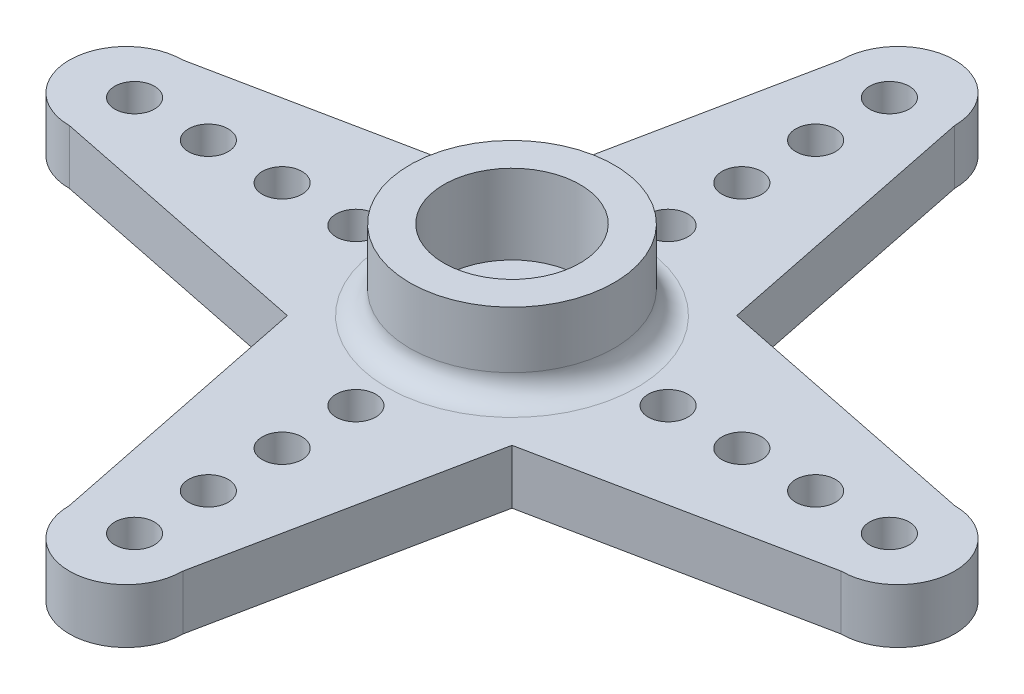
ISO-10303-21;
HEADER;
FILE_DESCRIPTION(('STEP AP214'),'2;1');
FILE_NAME('part.step','',(''),(''),'','','');
FILE_SCHEMA(('AUTOMOTIVE_DESIGN { 1 0 10303 214 1 1 1 1 }'));
ENDSEC;
DATA;
#1=APPLICATION_CONTEXT('core data for automotive mechanical design processes');
#2=APPLICATION_PROTOCOL_DEFINITION('international standard','automotive_design',2000,#1);
#3=PRODUCT_CONTEXT('',#1,'mechanical');
#4=PRODUCT('Part','Part','',(#3));
#5=PRODUCT_RELATED_PRODUCT_CATEGORY('part','',(#4));
#6=PRODUCT_DEFINITION_FORMATION('','',#4);
#7=PRODUCT_DEFINITION_CONTEXT('part definition',#1,'design');
#8=PRODUCT_DEFINITION('design','',#6,#7);
#9=PRODUCT_DEFINITION_SHAPE('','',#8);
#10=(LENGTH_UNIT() NAMED_UNIT(*) SI_UNIT(.MILLI.,.METRE.));
#11=(NAMED_UNIT(*) PLANE_ANGLE_UNIT() SI_UNIT($,.RADIAN.));
#12=(NAMED_UNIT(*) SI_UNIT($,.STERADIAN.) SOLID_ANGLE_UNIT());
#13=UNCERTAINTY_MEASURE_WITH_UNIT(LENGTH_MEASURE(1.E-05),#10,'distance_accuracy_value','');
#14=(GEOMETRIC_REPRESENTATION_CONTEXT(3) GLOBAL_UNCERTAINTY_ASSIGNED_CONTEXT((#13)) GLOBAL_UNIT_ASSIGNED_CONTEXT((#10,
#11,#12)) REPRESENTATION_CONTEXT('',''));
#15=CARTESIAN_POINT('',(0.,0.,0.));
#16=DIRECTION('',(0.,0.,1.));
#17=DIRECTION('',(1.,0.,0.));
#18=AXIS2_PLACEMENT_3D('',#15,#16,#17);
#19=CARTESIAN_POINT('',(0.,2.4,0.));
#20=DIRECTION('',(0.,-1.,0.));
#21=DIRECTION('',(0.,0.,-1.));
#22=AXIS2_PLACEMENT_3D('',#19,#20,#21);
#23=CYLINDRICAL_SURFACE('',#22,1.5);
#24=CARTESIAN_POINT('',(0.,2.4,0.));
#25=DIRECTION('',(0.,1.,0.));
#26=DIRECTION('',(0.,0.,1.));
#27=AXIS2_PLACEMENT_3D('',#24,#25,#26);
#28=CIRCLE('',#27,1.5);
#29=CARTESIAN_POINT('',(0.,2.4,1.5));
#30=VERTEX_POINT('',#29);
#31=EDGE_CURVE('E181',#30,#30,#28,.T.);
#32=ORIENTED_EDGE('',*,*,#31,.T.);
#33=EDGE_LOOP('',(#32));
#34=FACE_BOUND('',#33,.T.);
#35=CARTESIAN_POINT('',(0.,0.5,0.));
#36=DIRECTION('',(0.,-1.,0.));
#37=DIRECTION('',(0.,0.,-1.));
#38=AXIS2_PLACEMENT_3D('',#35,#36,#37);
#39=CIRCLE('',#38,1.5);
#40=CARTESIAN_POINT('',(0.,0.5,-1.5));
#41=VERTEX_POINT('',#40);
#42=EDGE_CURVE('E50',#41,#41,#39,.T.);
#43=ORIENTED_EDGE('',*,*,#42,.T.);
#44=EDGE_LOOP('',(#43));
#45=FACE_BOUND('',#44,.T.);
#46=ADVANCED_FACE('F46',(#34,#45),#23,.F.);
#47=CARTESIAN_POINT('',(0.,2.4,-17.0016457774429));
#48=DIRECTION('',(0.,1.,0.));
#49=DIRECTION('',(0.,0.,1.));
#50=AXIS2_PLACEMENT_3D('',#47,#48,#49);
#51=PLANE('',#50);
#52=CARTESIAN_POINT('',(10.1266457774429,2.4,0.));
#53=DIRECTION('',(0.,-1.,0.));
#54=DIRECTION('',(0.,0.,-1.));
#55=AXIS2_PLACEMENT_3D('',#52,#53,#54);
#56=CIRCLE('',#55,0.875000000000001);
#57=CARTESIAN_POINT('',(10.1266457774429,2.4,-0.875000000000037));
#58=VERTEX_POINT('',#57);
#59=EDGE_CURVE('E525',#58,#58,#56,.T.);
#60=ORIENTED_EDGE('',*,*,#59,.T.);
#61=EDGE_LOOP('',(#60));
#62=FACE_BOUND('',#61,.T.);
#63=CARTESIAN_POINT('',(16.6266457774429,2.4,0.));
#64=DIRECTION('',(0.,1.,0.));
#65=DIRECTION('',(0.,0.,1.));
#66=AXIS2_PLACEMENT_3D('',#63,#64,#65);
#67=CIRCLE('',#66,0.875000000000002);
#68=CARTESIAN_POINT('',(16.6266457774429,2.4,0.874999999999943));
#69=VERTEX_POINT('',#68);
#70=EDGE_CURVE('E589',#69,#69,#67,.F.);
#71=ORIENTED_EDGE('',*,*,#70,.T.);
#72=EDGE_LOOP('',(#71));
#73=FACE_BOUND('',#72,.T.);
#74=CARTESIAN_POINT('',(13.3766457774429,2.4,0.));
#75=DIRECTION('',(0.,1.,0.));
#76=DIRECTION('',(0.,0.,1.));
#77=AXIS2_PLACEMENT_3D('',#74,#75,#76);
#78=CIRCLE('',#77,0.875000000000001);
#79=CARTESIAN_POINT('',(13.3766457774429,2.4,0.874999999999953));
#80=VERTEX_POINT('',#79);
#81=EDGE_CURVE('E582',#80,#80,#78,.F.);
#82=ORIENTED_EDGE('',*,*,#81,.T.);
#83=EDGE_LOOP('',(#82));
#84=FACE_BOUND('',#83,.T.);
#85=CARTESIAN_POINT('',(6.87664577744287,2.4,0.));
#86=DIRECTION('',(0.,1.,0.));
#87=DIRECTION('',(0.,0.,1.));
#88=AXIS2_PLACEMENT_3D('',#85,#86,#87);
#89=CIRCLE('',#88,0.875000000000001);
#90=CARTESIAN_POINT('',(6.87664577744287,2.4,0.874999999999977));
#91=VERTEX_POINT('',#90);
#92=EDGE_CURVE('E578',#91,#91,#89,.F.);
#93=ORIENTED_EDGE('',*,*,#92,.T.);
#94=EDGE_LOOP('',(#93));
#95=FACE_BOUND('',#94,.T.);
#96=CARTESIAN_POINT('',(-6.87664577744287,2.4,0.));
#97=DIRECTION('',(0.,1.,0.));
#98=DIRECTION('',(0.,0.,1.));
#99=AXIS2_PLACEMENT_3D('',#96,#97,#98);
#100=CIRCLE('',#99,0.875);
#101=CARTESIAN_POINT('',(-6.87664577744287,2.4,0.87500000000007));
#102=VERTEX_POINT('',#101);
#103=EDGE_CURVE('E332',#102,#102,#100,.F.);
#104=ORIENTED_EDGE('',*,*,#103,.T.);
#105=EDGE_LOOP('',(#104));
#106=FACE_BOUND('',#105,.T.);
#107=CARTESIAN_POINT('',(-16.6266457774429,2.4,1.70002900645727E-13));
#108=DIRECTION('',(0.,1.,0.));
#109=DIRECTION('',(0.,0.,1.));
#110=AXIS2_PLACEMENT_3D('',#107,#108,#109);
#111=CIRCLE('',#110,0.875);
#112=CARTESIAN_POINT('',(-16.6266457774429,2.4,0.87500000000017));
#113=VERTEX_POINT('',#112);
#114=EDGE_CURVE('E510',#113,#113,#111,.F.);
#115=ORIENTED_EDGE('',*,*,#114,.T.);
#116=EDGE_LOOP('',(#115));
#117=FACE_BOUND('',#116,.T.);
#118=CARTESIAN_POINT('',(-13.3766457774429,2.4,1.37043154602168E-13));
#119=DIRECTION('',(0.,1.,0.));
#120=DIRECTION('',(0.,0.,1.));
#121=AXIS2_PLACEMENT_3D('',#118,#119,#120);
#122=CIRCLE('',#121,0.875000000000001);
#123=CARTESIAN_POINT('',(-13.3766457774429,2.4,0.875000000000138));
#124=VERTEX_POINT('',#123);
#125=EDGE_CURVE('E513',#124,#124,#122,.F.);
#126=ORIENTED_EDGE('',*,*,#125,.T.);
#127=EDGE_LOOP('',(#126));
#128=FACE_BOUND('',#127,.T.);
#129=CARTESIAN_POINT('',(-10.1266457774429,2.4,1.02348685082632E-13));
#130=DIRECTION('',(0.,1.,0.));
#131=DIRECTION('',(0.,0.,1.));
#132=AXIS2_PLACEMENT_3D('',#129,#130,#131);
#133=CIRCLE('',#132,0.875000000000001);
#134=CARTESIAN_POINT('',(-10.1266457774429,2.4,0.875000000000103));
#135=VERTEX_POINT('',#134);
#136=EDGE_CURVE('E519',#135,#135,#133,.F.);
#137=ORIENTED_EDGE('',*,*,#136,.T.);
#138=EDGE_LOOP('',(#137));
#139=FACE_BOUND('',#138,.T.);
#140=CARTESIAN_POINT('',(0.,2.4,0.));
#141=DIRECTION('',(0.,1.,0.));
#142=DIRECTION('',(0.,0.,1.));
#143=AXIS2_PLACEMENT_3D('',#140,#141,#142);
#144=CIRCLE('',#143,5.5);
#145=CARTESIAN_POINT('',(0.,2.4,5.5));
#146=VERTEX_POINT('',#145);
#147=EDGE_CURVE('E12',#146,#146,#144,.F.);
#148=ORIENTED_EDGE('',*,*,#147,.T.);
#149=EDGE_LOOP('',(#148));
#150=FACE_BOUND('',#149,.T.);
#151=DIRECTION('',(-0.199193114188229,0.,-0.979960255959391));
#152=VECTOR('',#151,1.);
#153=CARTESIAN_POINT('',(4.94974746830583,2.4,-4.94974746830583));
#154=LINE('',#153,#152);
#155=CARTESIAN_POINT('',(4.94974746830583,2.4,-4.94974746830583));
#156=VERTEX_POINT('',#155);
#157=CARTESIAN_POINT('',(2.5,2.4,-17.0016457774429));
#158=VERTEX_POINT('',#157);
#159=EDGE_CURVE('E211',#156,#158,#154,.T.);
#160=ORIENTED_EDGE('',*,*,#159,.T.);
#161=CARTESIAN_POINT('',(0.,2.4,-17.0016457774429));
#162=DIRECTION('',(0.,1.,0.));
#163=DIRECTION('',(0.,0.,1.));
#164=AXIS2_PLACEMENT_3D('',#161,#162,#163);
#165=CIRCLE('',#164,2.5);
#166=CARTESIAN_POINT('',(-2.5,2.4,-17.0016457774429));
#167=VERTEX_POINT('',#166);
#168=EDGE_CURVE('E122',#158,#167,#165,.T.);
#169=ORIENTED_EDGE('',*,*,#168,.T.);
#170=DIRECTION('',(-0.199193114188229,0.,0.979960255959391));
#171=VECTOR('',#170,1.);
#172=CARTESIAN_POINT('',(-2.5,2.4,-17.0016457774429));
#173=LINE('',#172,#171);
#174=CARTESIAN_POINT('',(-4.94974746830583,2.4,-4.94974746830583));
#175=VERTEX_POINT('',#174);
#176=EDGE_CURVE('E342',#167,#175,#173,.T.);
#177=ORIENTED_EDGE('',*,*,#176,.T.);
#178=DIRECTION('',(-0.979952252684368,0.,0.199232483442915));
#179=VECTOR('',#178,1.);
#180=CARTESIAN_POINT('',(-16.999165859268,2.4,-2.5));
#181=LINE('',#180,#179);
#182=CARTESIAN_POINT('',(-16.999165859268,2.4,-2.5));
#183=VERTEX_POINT('',#182);
#184=EDGE_CURVE('E345',#175,#183,#181,.T.);
#185=ORIENTED_EDGE('',*,*,#184,.T.);
#186=CARTESIAN_POINT('',(-16.999165859268,2.4,0.));
#187=DIRECTION('',(0.,1.,0.));
#188=DIRECTION('',(0.,0.,1.));
#189=AXIS2_PLACEMENT_3D('',#186,#187,#188);
#190=CIRCLE('',#189,2.5);
#191=CARTESIAN_POINT('',(-16.999165859268,2.4,2.5));
#192=VERTEX_POINT('',#191);
#193=EDGE_CURVE('E348',#183,#192,#190,.T.);
#194=ORIENTED_EDGE('',*,*,#193,.T.);
#195=DIRECTION('',(0.979952252684368,0.,0.199232483442915));
#196=VECTOR('',#195,1.);
#197=CARTESIAN_POINT('',(-16.999165859268,2.4,2.5));
#198=LINE('',#197,#196);
#199=CARTESIAN_POINT('',(-4.94974746830583,2.4,4.94974746830583));
#200=VERTEX_POINT('',#199);
#201=EDGE_CURVE('E351',#192,#200,#198,.T.);
#202=ORIENTED_EDGE('',*,*,#201,.T.);
#203=DIRECTION('',(0.199219905240093,0.,0.979954809854071));
#204=VECTOR('',#203,1.);
#205=CARTESIAN_POINT('',(-4.94974746830583,2.4,4.94974746830583));
#206=LINE('',#205,#204);
#207=CARTESIAN_POINT('',(-2.5,2.4,16.9999580715132));
#208=VERTEX_POINT('',#207);
#209=EDGE_CURVE('E354',#200,#208,#206,.T.);
#210=ORIENTED_EDGE('',*,*,#209,.T.);
#211=CARTESIAN_POINT('',(0.,2.4,16.9999580715132));
#212=DIRECTION('',(0.,1.,0.));
#213=DIRECTION('',(0.,0.,1.));
#214=AXIS2_PLACEMENT_3D('',#211,#212,#213);
#215=CIRCLE('',#214,2.5);
#216=CARTESIAN_POINT('',(2.5,2.4,16.9999580715132));
#217=VERTEX_POINT('',#216);
#218=EDGE_CURVE('E357',#208,#217,#215,.T.);
#219=ORIENTED_EDGE('',*,*,#218,.T.);
#220=DIRECTION('',(0.199219905240093,0.,-0.979954809854071));
#221=VECTOR('',#220,1.);
#222=CARTESIAN_POINT('',(2.5,2.4,16.9999580715132));
#223=LINE('',#222,#221);
#224=CARTESIAN_POINT('',(4.94974746830583,2.4,4.94974746830583));
#225=VERTEX_POINT('',#224);
#226=EDGE_CURVE('E154',#217,#225,#223,.T.);
#227=ORIENTED_EDGE('',*,*,#226,.T.);
#228=DIRECTION('',(0.97995783729977,0.,-0.199205012775174));
#229=VECTOR('',#228,1.);
#230=CARTESIAN_POINT('',(4.94974746830583,2.4,4.94974746830583));
#231=LINE('',#230,#229);
#232=CARTESIAN_POINT('',(17.0008961694732,2.4,2.5));
#233=VERTEX_POINT('',#232);
#234=EDGE_CURVE('E147',#225,#233,#231,.T.);
#235=ORIENTED_EDGE('',*,*,#234,.T.);
#236=CARTESIAN_POINT('',(17.0008961694732,2.4,0.));
#237=DIRECTION('',(0.,1.,0.));
#238=DIRECTION('',(0.,0.,1.));
#239=AXIS2_PLACEMENT_3D('',#236,#237,#238);
#240=CIRCLE('',#239,2.5);
#241=CARTESIAN_POINT('',(17.0008961694732,2.4,-2.5));
#242=VERTEX_POINT('',#241);
#243=EDGE_CURVE('E152',#233,#242,#240,.T.);
#244=ORIENTED_EDGE('',*,*,#243,.T.);
#245=DIRECTION('',(-0.97995783729977,0.,-0.199205012775174));
#246=VECTOR('',#245,1.);
#247=CARTESIAN_POINT('',(17.0008961694732,2.4,-2.5));
#248=LINE('',#247,#246);
#249=EDGE_CURVE('E66',#242,#156,#248,.T.);
#250=ORIENTED_EDGE('',*,*,#249,.T.);
#251=EDGE_LOOP('',(#160,#169,#177,#185,#194,#202,#210,#219,#227,#235,#244,#250));
#252=FACE_BOUND('',#251,.T.);
#253=CARTESIAN_POINT('',(0.,2.4,-6.87664577744287));
#254=DIRECTION('',(0.,1.,0.));
#255=DIRECTION('',(0.,0.,1.));
#256=AXIS2_PLACEMENT_3D('',#253,#254,#255);
#257=CIRCLE('',#256,0.875);
#258=CARTESIAN_POINT('',(0.,2.4,-6.00164577744287));
#259=VERTEX_POINT('',#258);
#260=EDGE_CURVE('E514',#259,#259,#257,.T.);
#261=ORIENTED_EDGE('',*,*,#260,.F.);
#262=EDGE_LOOP('',(#261));
#263=FACE_BOUND('',#262,.T.);
#264=CARTESIAN_POINT('',(0.,2.4,6.87664577744287));
#265=DIRECTION('',(0.,1.,0.));
#266=DIRECTION('',(0.,0.,1.));
#267=AXIS2_PLACEMENT_3D('',#264,#265,#266);
#268=CIRCLE('',#267,0.875);
#269=CARTESIAN_POINT('',(0.,2.4,7.75164577744287));
#270=VERTEX_POINT('',#269);
#271=EDGE_CURVE('E538',#270,#270,#268,.T.);
#272=ORIENTED_EDGE('',*,*,#271,.F.);
#273=EDGE_LOOP('',(#272));
#274=FACE_BOUND('',#273,.T.);
#275=CARTESIAN_POINT('',(0.,2.4,10.1266457774429));
#276=DIRECTION('',(0.,1.,0.));
#277=DIRECTION('',(0.,0.,1.));
#278=AXIS2_PLACEMENT_3D('',#275,#276,#277);
#279=CIRCLE('',#278,0.875000000000001);
#280=CARTESIAN_POINT('',(0.,2.4,11.0016457774429));
#281=VERTEX_POINT('',#280);
#282=EDGE_CURVE('E535',#281,#281,#279,.T.);
#283=ORIENTED_EDGE('',*,*,#282,.F.);
#284=EDGE_LOOP('',(#283));
#285=FACE_BOUND('',#284,.T.);
#286=CARTESIAN_POINT('',(0.,2.4,13.3766457774429));
#287=DIRECTION('',(0.,1.,0.));
#288=DIRECTION('',(0.,0.,1.));
#289=AXIS2_PLACEMENT_3D('',#286,#287,#288);
#290=CIRCLE('',#289,0.875000000000002);
#291=CARTESIAN_POINT('',(0.,2.4,14.2516457774429));
#292=VERTEX_POINT('',#291);
#293=EDGE_CURVE('E531',#292,#292,#290,.T.);
#294=ORIENTED_EDGE('',*,*,#293,.F.);
#295=EDGE_LOOP('',(#294));
#296=FACE_BOUND('',#295,.T.);
#297=CARTESIAN_POINT('',(0.,2.4,-16.6266457774429));
#298=DIRECTION('',(0.,1.,0.));
#299=DIRECTION('',(0.,0.,1.));
#300=AXIS2_PLACEMENT_3D('',#297,#298,#299);
#301=CIRCLE('',#300,0.875);
#302=CARTESIAN_POINT('',(0.,2.4,-15.7516457774429));
#303=VERTEX_POINT('',#302);
#304=EDGE_CURVE('E561',#303,#303,#301,.T.);
#305=ORIENTED_EDGE('',*,*,#304,.F.);
#306=EDGE_LOOP('',(#305));
#307=FACE_BOUND('',#306,.T.);
#308=CARTESIAN_POINT('',(0.,2.4,-13.3766457774429));
#309=DIRECTION('',(0.,1.,0.));
#310=DIRECTION('',(0.,0.,1.));
#311=AXIS2_PLACEMENT_3D('',#308,#309,#310);
#312=CIRCLE('',#311,0.875);
#313=CARTESIAN_POINT('',(0.,2.4,-12.5016457774429));
#314=VERTEX_POINT('',#313);
#315=EDGE_CURVE('E565',#314,#314,#312,.T.);
#316=ORIENTED_EDGE('',*,*,#315,.F.);
#317=EDGE_LOOP('',(#316));
#318=FACE_BOUND('',#317,.T.);
#319=CARTESIAN_POINT('',(0.,2.4,-10.1266457774429));
#320=DIRECTION('',(0.,1.,0.));
#321=DIRECTION('',(0.,0.,1.));
#322=AXIS2_PLACEMENT_3D('',#319,#320,#321);
#323=CIRCLE('',#322,0.875);
#324=CARTESIAN_POINT('',(0.,2.4,-9.25164577744287));
#325=VERTEX_POINT('',#324);
#326=EDGE_CURVE('E522',#325,#325,#323,.T.);
#327=ORIENTED_EDGE('',*,*,#326,.F.);
#328=EDGE_LOOP('',(#327));
#329=FACE_BOUND('',#328,.T.);
#330=CARTESIAN_POINT('',(1.11022302462516E-13,2.4,16.6266457774429));
#331=DIRECTION('',(0.,1.,0.));
#332=DIRECTION('',(0.,0.,1.));
#333=AXIS2_PLACEMENT_3D('',#330,#331,#332);
#334=CIRCLE('',#333,0.875000000000002);
#335=CARTESIAN_POINT('',(1.11022302462516E-13,2.4,17.5016457774429));
#336=VERTEX_POINT('',#335);
#337=EDGE_CURVE('E261',#336,#336,#334,.T.);
#338=ORIENTED_EDGE('',*,*,#337,.F.);
#339=EDGE_LOOP('',(#338));
#340=FACE_BOUND('',#339,.T.);
#341=ADVANCED_FACE('F149',(#62,#73,#84,#95,#106,#117,#128,#139,#150,#252,#263,#274,#285,#296,
#307,#318,#329,#340),#51,.T.);
#342=CARTESIAN_POINT('',(0.,0.,-17.0016457774429));
#343=DIRECTION('',(0.,1.,0.));
#344=DIRECTION('',(0.,0.,1.));
#345=AXIS2_PLACEMENT_3D('',#342,#343,#344);
#346=PLANE('',#345);
#347=CARTESIAN_POINT('',(0.,0.,0.));
#348=DIRECTION('',(0.,-1.,0.));
#349=DIRECTION('',(0.,0.,-1.));
#350=AXIS2_PLACEMENT_3D('',#347,#348,#349);
#351=CIRCLE('',#350,4.375);
#352=CARTESIAN_POINT('',(0.,0.,-4.375));
#353=VERTEX_POINT('',#352);
#354=EDGE_CURVE('E412',#353,#353,#351,.T.);
#355=ORIENTED_EDGE('',*,*,#354,.F.);
#356=EDGE_LOOP('',(#355));
#357=FACE_BOUND('',#356,.T.);
#358=CARTESIAN_POINT('',(0.,0.,-10.1266457774429));
#359=DIRECTION('',(0.,1.,0.));
#360=DIRECTION('',(0.,0.,1.));
#361=AXIS2_PLACEMENT_3D('',#358,#359,#360);
#362=CIRCLE('',#361,0.875);
#363=CARTESIAN_POINT('',(0.,0.,-9.25164577744287));
#364=VERTEX_POINT('',#363);
#365=EDGE_CURVE('E301',#364,#364,#362,.T.);
#366=ORIENTED_EDGE('',*,*,#365,.T.);
#367=EDGE_LOOP('',(#366));
#368=FACE_BOUND('',#367,.T.);
#369=CARTESIAN_POINT('',(0.,0.,-16.6266457774429));
#370=DIRECTION('',(0.,1.,0.));
#371=DIRECTION('',(0.,0.,1.));
#372=AXIS2_PLACEMENT_3D('',#369,#370,#371);
#373=CIRCLE('',#372,0.875);
#374=CARTESIAN_POINT('',(0.,0.,-15.7516457774429));
#375=VERTEX_POINT('',#374);
#376=EDGE_CURVE('E293',#375,#375,#373,.T.);
#377=ORIENTED_EDGE('',*,*,#376,.T.);
#378=EDGE_LOOP('',(#377));
#379=FACE_BOUND('',#378,.T.);
#380=CARTESIAN_POINT('',(6.87664577744287,0.,0.));
#381=DIRECTION('',(0.,1.,0.));
#382=DIRECTION('',(0.,0.,1.));
#383=AXIS2_PLACEMENT_3D('',#380,#381,#382);
#384=CIRCLE('',#383,0.875000000000001);
#385=CARTESIAN_POINT('',(6.87664577744287,0.,0.874999999999977));
#386=VERTEX_POINT('',#385);
#387=EDGE_CURVE('E289',#386,#386,#384,.F.);
#388=ORIENTED_EDGE('',*,*,#387,.F.);
#389=EDGE_LOOP('',(#388));
#390=FACE_BOUND('',#389,.T.);
#391=CARTESIAN_POINT('',(0.,0.,10.1266457774429));
#392=DIRECTION('',(0.,1.,0.));
#393=DIRECTION('',(0.,0.,1.));
#394=AXIS2_PLACEMENT_3D('',#391,#392,#393);
#395=CIRCLE('',#394,0.875000000000001);
#396=CARTESIAN_POINT('',(0.,0.,11.0016457774429));
#397=VERTEX_POINT('',#396);
#398=EDGE_CURVE('E281',#397,#397,#395,.T.);
#399=ORIENTED_EDGE('',*,*,#398,.T.);
#400=EDGE_LOOP('',(#399));
#401=FACE_BOUND('',#400,.T.);
#402=CARTESIAN_POINT('',(0.,0.,-6.87664577744287));
#403=DIRECTION('',(0.,1.,0.));
#404=DIRECTION('',(0.,0.,1.));
#405=AXIS2_PLACEMENT_3D('',#402,#403,#404);
#406=CIRCLE('',#405,0.875);
#407=CARTESIAN_POINT('',(0.,0.,-6.00164577744287));
#408=VERTEX_POINT('',#407);
#409=EDGE_CURVE('E269',#408,#408,#406,.T.);
#410=ORIENTED_EDGE('',*,*,#409,.T.);
#411=EDGE_LOOP('',(#410));
#412=FACE_BOUND('',#411,.T.);
#413=CARTESIAN_POINT('',(-16.6266457774429,0.,1.70002900645727E-13));
#414=DIRECTION('',(0.,1.,0.));
#415=DIRECTION('',(0.,0.,1.));
#416=AXIS2_PLACEMENT_3D('',#413,#414,#415);
#417=CIRCLE('',#416,0.875);
#418=CARTESIAN_POINT('',(-16.6266457774429,0.,0.87500000000017));
#419=VERTEX_POINT('',#418);
#420=EDGE_CURVE('E265',#419,#419,#417,.F.);
#421=ORIENTED_EDGE('',*,*,#420,.F.);
#422=EDGE_LOOP('',(#421));
#423=FACE_BOUND('',#422,.T.);
#424=CARTESIAN_POINT('',(-13.3766457774429,0.,1.37043154602168E-13));
#425=DIRECTION('',(0.,1.,0.));
#426=DIRECTION('',(0.,0.,1.));
#427=AXIS2_PLACEMENT_3D('',#424,#425,#426);
#428=CIRCLE('',#427,0.875000000000001);
#429=CARTESIAN_POINT('',(-13.3766457774429,0.,0.875000000000138));
#430=VERTEX_POINT('',#429);
#431=EDGE_CURVE('E260',#430,#430,#428,.F.);
#432=ORIENTED_EDGE('',*,*,#431,.F.);
#433=EDGE_LOOP('',(#432));
#434=FACE_BOUND('',#433,.T.);
#435=CARTESIAN_POINT('',(-10.1266457774429,0.,1.02348685082632E-13));
#436=DIRECTION('',(0.,1.,0.));
#437=DIRECTION('',(0.,0.,1.));
#438=AXIS2_PLACEMENT_3D('',#435,#436,#437);
#439=CIRCLE('',#438,0.875000000000001);
#440=CARTESIAN_POINT('',(-10.1266457774429,0.,0.875000000000103));
#441=VERTEX_POINT('',#440);
#442=EDGE_CURVE('E256',#441,#441,#439,.F.);
#443=ORIENTED_EDGE('',*,*,#442,.F.);
#444=EDGE_LOOP('',(#443));
#445=FACE_BOUND('',#444,.T.);
#446=DIRECTION('',(-0.199193114188229,0.,-0.979960255959391));
#447=VECTOR('',#446,1.);
#448=CARTESIAN_POINT('',(4.94974746830583,0.,-4.94974746830583));
#449=LINE('',#448,#447);
#450=CARTESIAN_POINT('',(4.94974746830583,0.,-4.94974746830583));
#451=VERTEX_POINT('',#450);
#452=CARTESIAN_POINT('',(2.5,0.,-17.0016457774429));
#453=VERTEX_POINT('',#452);
#454=EDGE_CURVE('E176',#451,#453,#449,.T.);
#455=ORIENTED_EDGE('',*,*,#454,.F.);
#456=DIRECTION('',(-0.97995783729977,0.,-0.199205012775174));
#457=VECTOR('',#456,1.);
#458=CARTESIAN_POINT('',(17.0008961694732,0.,-2.5));
#459=LINE('',#458,#457);
#460=CARTESIAN_POINT('',(17.0008961694732,0.,-2.5));
#461=VERTEX_POINT('',#460);
#462=EDGE_CURVE('E113',#461,#451,#459,.T.);
#463=ORIENTED_EDGE('',*,*,#462,.F.);
#464=CARTESIAN_POINT('',(17.0008961694732,0.,0.));
#465=DIRECTION('',(0.,1.,0.));
#466=DIRECTION('',(0.,0.,1.));
#467=AXIS2_PLACEMENT_3D('',#464,#465,#466);
#468=CIRCLE('',#467,2.5);
#469=CARTESIAN_POINT('',(17.0008961694732,0.,2.5));
#470=VERTEX_POINT('',#469);
#471=EDGE_CURVE('E107',#470,#461,#468,.T.);
#472=ORIENTED_EDGE('',*,*,#471,.F.);
#473=DIRECTION('',(0.97995783729977,0.,-0.199205012775174));
#474=VECTOR('',#473,1.);
#475=CARTESIAN_POINT('',(4.94974746830583,0.,4.94974746830583));
#476=LINE('',#475,#474);
#477=CARTESIAN_POINT('',(4.94974746830583,0.,4.94974746830583));
#478=VERTEX_POINT('',#477);
#479=EDGE_CURVE('E163',#478,#470,#476,.T.);
#480=ORIENTED_EDGE('',*,*,#479,.F.);
#481=DIRECTION('',(0.199219905240093,0.,-0.979954809854071));
#482=VECTOR('',#481,1.);
#483=CARTESIAN_POINT('',(2.5,0.,16.9999580715132));
#484=LINE('',#483,#482);
#485=CARTESIAN_POINT('',(2.5,0.,16.9999580715132));
#486=VERTEX_POINT('',#485);
#487=EDGE_CURVE('E202',#486,#478,#484,.T.);
#488=ORIENTED_EDGE('',*,*,#487,.F.);
#489=CARTESIAN_POINT('',(0.,0.,16.9999580715132));
#490=DIRECTION('',(0.,1.,0.));
#491=DIRECTION('',(0.,0.,1.));
#492=AXIS2_PLACEMENT_3D('',#489,#490,#491);
#493=CIRCLE('',#492,2.5);
#494=CARTESIAN_POINT('',(-2.5,0.,16.9999580715132));
#495=VERTEX_POINT('',#494);
#496=EDGE_CURVE('E199',#495,#486,#493,.T.);
#497=ORIENTED_EDGE('',*,*,#496,.F.);
#498=DIRECTION('',(0.199219905240093,0.,0.979954809854071));
#499=VECTOR('',#498,1.);
#500=CARTESIAN_POINT('',(-4.94974746830583,0.,4.94974746830583));
#501=LINE('',#500,#499);
#502=CARTESIAN_POINT('',(-4.94974746830583,0.,4.94974746830583));
#503=VERTEX_POINT('',#502);
#504=EDGE_CURVE('E196',#503,#495,#501,.T.);
#505=ORIENTED_EDGE('',*,*,#504,.F.);
#506=DIRECTION('',(0.979952252684368,0.,0.199232483442915));
#507=VECTOR('',#506,1.);
#508=CARTESIAN_POINT('',(-16.999165859268,0.,2.5));
#509=LINE('',#508,#507);
#510=CARTESIAN_POINT('',(-16.999165859268,0.,2.5));
#511=VERTEX_POINT('',#510);
#512=EDGE_CURVE('E193',#511,#503,#509,.T.);
#513=ORIENTED_EDGE('',*,*,#512,.F.);
#514=CARTESIAN_POINT('',(-16.999165859268,0.,0.));
#515=DIRECTION('',(0.,1.,0.));
#516=DIRECTION('',(0.,0.,1.));
#517=AXIS2_PLACEMENT_3D('',#514,#515,#516);
#518=CIRCLE('',#517,2.5);
#519=CARTESIAN_POINT('',(-16.999165859268,0.,-2.5));
#520=VERTEX_POINT('',#519);
#521=EDGE_CURVE('E190',#520,#511,#518,.T.);
#522=ORIENTED_EDGE('',*,*,#521,.F.);
#523=DIRECTION('',(-0.979952252684368,0.,0.199232483442915));
#524=VECTOR('',#523,1.);
#525=CARTESIAN_POINT('',(-16.999165859268,0.,-2.5));
#526=LINE('',#525,#524);
#527=CARTESIAN_POINT('',(-4.94974746830583,0.,-4.94974746830583));
#528=VERTEX_POINT('',#527);
#529=EDGE_CURVE('E187',#528,#520,#526,.T.);
#530=ORIENTED_EDGE('',*,*,#529,.F.);
#531=DIRECTION('',(-0.199193114188229,0.,0.979960255959391));
#532=VECTOR('',#531,1.);
#533=CARTESIAN_POINT('',(-2.5,0.,-17.0016457774429));
#534=LINE('',#533,#532);
#535=CARTESIAN_POINT('',(-2.5,0.,-17.0016457774429));
#536=VERTEX_POINT('',#535);
#537=EDGE_CURVE('E184',#536,#528,#534,.T.);
#538=ORIENTED_EDGE('',*,*,#537,.F.);
#539=CARTESIAN_POINT('',(0.,0.,-17.0016457774429));
#540=DIRECTION('',(0.,1.,0.));
#541=DIRECTION('',(0.,0.,1.));
#542=AXIS2_PLACEMENT_3D('',#539,#540,#541);
#543=CIRCLE('',#542,2.5);
#544=EDGE_CURVE('E180',#453,#536,#543,.T.);
#545=ORIENTED_EDGE('',*,*,#544,.F.);
#546=EDGE_LOOP('',(#455,#463,#472,#480,#488,#497,#505,#513,#522,#530,#538,#545));
#547=FACE_BOUND('',#546,.T.);
#548=CARTESIAN_POINT('',(-6.87664577744287,0.,0.));
#549=DIRECTION('',(0.,1.,0.));
#550=DIRECTION('',(0.,0.,1.));
#551=AXIS2_PLACEMENT_3D('',#548,#549,#550);
#552=CIRCLE('',#551,0.875);
#553=CARTESIAN_POINT('',(-6.87664577744287,0.,0.87500000000007));
#554=VERTEX_POINT('',#553);
#555=EDGE_CURVE('E273',#554,#554,#552,.F.);
#556=ORIENTED_EDGE('',*,*,#555,.F.);
#557=EDGE_LOOP('',(#556));
#558=FACE_BOUND('',#557,.T.);
#559=CARTESIAN_POINT('',(0.,0.,6.87664577744287));
#560=DIRECTION('',(0.,1.,0.));
#561=DIRECTION('',(0.,0.,1.));
#562=AXIS2_PLACEMENT_3D('',#559,#560,#561);
#563=CIRCLE('',#562,0.875);
#564=CARTESIAN_POINT('',(0.,0.,7.75164577744287));
#565=VERTEX_POINT('',#564);
#566=EDGE_CURVE('E277',#565,#565,#563,.T.);
#567=ORIENTED_EDGE('',*,*,#566,.T.);
#568=EDGE_LOOP('',(#567));
#569=FACE_BOUND('',#568,.T.);
#570=CARTESIAN_POINT('',(0.,0.,13.3766457774429));
#571=DIRECTION('',(0.,1.,0.));
#572=DIRECTION('',(0.,0.,1.));
#573=AXIS2_PLACEMENT_3D('',#570,#571,#572);
#574=CIRCLE('',#573,0.875000000000002);
#575=CARTESIAN_POINT('',(0.,0.,14.2516457774429));
#576=VERTEX_POINT('',#575);
#577=EDGE_CURVE('E285',#576,#576,#574,.T.);
#578=ORIENTED_EDGE('',*,*,#577,.T.);
#579=EDGE_LOOP('',(#578));
#580=FACE_BOUND('',#579,.T.);
#581=CARTESIAN_POINT('',(0.,0.,-13.3766457774429));
#582=DIRECTION('',(0.,1.,0.));
#583=DIRECTION('',(0.,0.,1.));
#584=AXIS2_PLACEMENT_3D('',#581,#582,#583);
#585=CIRCLE('',#584,0.875);
#586=CARTESIAN_POINT('',(0.,0.,-12.5016457774429));
#587=VERTEX_POINT('',#586);
#588=EDGE_CURVE('E297',#587,#587,#585,.T.);
#589=ORIENTED_EDGE('',*,*,#588,.T.);
#590=EDGE_LOOP('',(#589));
#591=FACE_BOUND('',#590,.T.);
#592=CARTESIAN_POINT('',(13.3766457774429,0.,0.));
#593=DIRECTION('',(0.,1.,0.));
#594=DIRECTION('',(0.,0.,1.));
#595=AXIS2_PLACEMENT_3D('',#592,#593,#594);
#596=CIRCLE('',#595,0.875000000000001);
#597=CARTESIAN_POINT('',(13.3766457774429,0.,0.874999999999953));
#598=VERTEX_POINT('',#597);
#599=EDGE_CURVE('E305',#598,#598,#596,.F.);
#600=ORIENTED_EDGE('',*,*,#599,.F.);
#601=EDGE_LOOP('',(#600));
#602=FACE_BOUND('',#601,.T.);
#603=CARTESIAN_POINT('',(16.6266457774429,0.,0.));
#604=DIRECTION('',(0.,1.,0.));
#605=DIRECTION('',(0.,0.,1.));
#606=AXIS2_PLACEMENT_3D('',#603,#604,#605);
#607=CIRCLE('',#606,0.875000000000002);
#608=CARTESIAN_POINT('',(16.6266457774429,0.,0.874999999999943));
#609=VERTEX_POINT('',#608);
#610=EDGE_CURVE('E309',#609,#609,#607,.F.);
#611=ORIENTED_EDGE('',*,*,#610,.F.);
#612=EDGE_LOOP('',(#611));
#613=FACE_BOUND('',#612,.T.);
#614=CARTESIAN_POINT('',(10.1266457774429,0.,0.));
#615=DIRECTION('',(0.,1.,0.));
#616=DIRECTION('',(0.,0.,1.));
#617=AXIS2_PLACEMENT_3D('',#614,#615,#616);
#618=CIRCLE('',#617,0.875000000000001);
#619=CARTESIAN_POINT('',(10.1266457774429,0.,0.874999999999964));
#620=VERTEX_POINT('',#619);
#621=EDGE_CURVE('E313',#620,#620,#618,.F.);
#622=ORIENTED_EDGE('',*,*,#621,.F.);
#623=EDGE_LOOP('',(#622));
#624=FACE_BOUND('',#623,.T.);
#625=CARTESIAN_POINT('',(1.11022302462516E-13,0.,16.6266457774429));
#626=DIRECTION('',(0.,1.,0.));
#627=DIRECTION('',(0.,0.,1.));
#628=AXIS2_PLACEMENT_3D('',#625,#626,#627);
#629=CIRCLE('',#628,0.875000000000002);
#630=CARTESIAN_POINT('',(1.11022302462516E-13,0.,17.5016457774429));
#631=VERTEX_POINT('',#630);
#632=EDGE_CURVE('E316',#631,#631,#629,.T.);
#633=ORIENTED_EDGE('',*,*,#632,.T.);
#634=EDGE_LOOP('',(#633));
#635=FACE_BOUND('',#634,.T.);
#636=ADVANCED_FACE('F372',(#357,#368,#379,#390,#401,#412,#423,#434,#445,#547,#558,#569,#580,
#591,#602,#613,#624,#635),#346,.F.);
#637=CARTESIAN_POINT('',(0.,3.4,0.));
#638=DIRECTION('',(0.,1.,0.));
#639=DIRECTION('',(0.,0.,1.));
#640=AXIS2_PLACEMENT_3D('',#637,#638,#639);
#641=TOROIDAL_SURFACE('',#640,5.5,1.);
#642=CARTESIAN_POINT('',(0.,3.4,0.));
#643=DIRECTION('',(0.,1.,0.));
#644=DIRECTION('',(0.,0.,1.));
#645=AXIS2_PLACEMENT_3D('',#642,#643,#644);
#646=CIRCLE('',#645,4.5);
#647=CARTESIAN_POINT('',(0.,3.4,4.5));
#648=VERTEX_POINT('',#647);
#649=EDGE_CURVE('E57',#648,#648,#646,.T.);
#650=ORIENTED_EDGE('',*,*,#649,.F.);
#651=EDGE_LOOP('',(#650));
#652=FACE_BOUND('',#651,.T.);
#653=ORIENTED_EDGE('',*,*,#147,.F.);
#654=EDGE_LOOP('',(#653));
#655=FACE_BOUND('',#654,.T.);
#656=ADVANCED_FACE('F48',(#652,#655),#641,.F.);
#657=ORIENTED_EDGE('',*,*,#31,.F.);
#658=EDGE_LOOP('',(#657));
#659=FACE_BOUND('',#658,.T.);
#660=CARTESIAN_POINT('',(0.,2.4,0.));
#661=DIRECTION('',(0.,1.,0.));
#662=DIRECTION('',(0.,0.,1.));
#663=AXIS2_PLACEMENT_3D('',#660,#661,#662);
#664=CIRCLE('',#663,3.);
#665=CARTESIAN_POINT('',(0.,2.4,3.));
#666=VERTEX_POINT('',#665);
#667=EDGE_CURVE('E249',#666,#666,#664,.F.);
#668=ORIENTED_EDGE('',*,*,#667,.F.);
#669=EDGE_LOOP('',(#668));
#670=FACE_BOUND('',#669,.T.);
#671=ADVANCED_FACE('F400',(#659,#670),#51,.T.);
#672=CARTESIAN_POINT('',(4.94974746830583,2.4,-4.94974746830583));
#673=DIRECTION('',(-0.979960255959391,0.,0.199193114188229));
#674=DIRECTION('',(0.199193114188229,0.,0.979960255959391));
#675=AXIS2_PLACEMENT_3D('',#672,#673,#674);
#676=PLANE('',#675);
#677=ORIENTED_EDGE('',*,*,#454,.T.);
#678=DIRECTION('',(0.,-1.,0.));
#679=VECTOR('',#678,1.);
#680=CARTESIAN_POINT('',(2.5,2.4,-17.0016457774429));
#681=LINE('',#680,#679);
#682=EDGE_CURVE('E246',#158,#453,#681,.T.);
#683=ORIENTED_EDGE('',*,*,#682,.F.);
#684=ORIENTED_EDGE('',*,*,#159,.F.);
#685=DIRECTION('',(0.,-1.,0.));
#686=VECTOR('',#685,1.);
#687=CARTESIAN_POINT('',(4.94974746830583,2.4,-4.94974746830583));
#688=LINE('',#687,#686);
#689=EDGE_CURVE('E172',#156,#451,#688,.T.);
#690=ORIENTED_EDGE('',*,*,#689,.T.);
#691=EDGE_LOOP('',(#677,#683,#684,#690));
#692=FACE_BOUND('',#691,.T.);
#693=ADVANCED_FACE('F377',(#692),#676,.F.);
#694=CARTESIAN_POINT('',(0.,2.4,-17.0016457774429));
#695=DIRECTION('',(0.,-1.,0.));
#696=DIRECTION('',(0.,0.,-1.));
#697=AXIS2_PLACEMENT_3D('',#694,#695,#696);
#698=CYLINDRICAL_SURFACE('',#697,2.5);
#699=ORIENTED_EDGE('',*,*,#544,.T.);
#700=DIRECTION('',(0.,-1.,0.));
#701=VECTOR('',#700,1.);
#702=CARTESIAN_POINT('',(-2.5,2.4,-17.0016457774429));
#703=LINE('',#702,#701);
#704=EDGE_CURVE('E242',#167,#536,#703,.T.);
#705=ORIENTED_EDGE('',*,*,#704,.F.);
#706=ORIENTED_EDGE('',*,*,#168,.F.);
#707=ORIENTED_EDGE('',*,*,#682,.T.);
#708=EDGE_LOOP('',(#699,#705,#706,#707));
#709=FACE_BOUND('',#708,.T.);
#710=ADVANCED_FACE('F920',(#709),#698,.T.);
#711=CARTESIAN_POINT('',(-2.5,2.4,-17.0016457774429));
#712=DIRECTION('',(0.979960255959391,0.,0.199193114188229));
#713=DIRECTION('',(0.199193114188229,0.,-0.979960255959391));
#714=AXIS2_PLACEMENT_3D('',#711,#712,#713);
#715=PLANE('',#714);
#716=ORIENTED_EDGE('',*,*,#537,.T.);
#717=DIRECTION('',(0.,-1.,0.));
#718=VECTOR('',#717,1.);
#719=CARTESIAN_POINT('',(-4.94974746830583,2.4,-4.94974746830583));
#720=LINE('',#719,#718);
#721=EDGE_CURVE('E238',#175,#528,#720,.T.);
#722=ORIENTED_EDGE('',*,*,#721,.F.);
#723=ORIENTED_EDGE('',*,*,#176,.F.);
#724=ORIENTED_EDGE('',*,*,#704,.T.);
#725=EDGE_LOOP('',(#716,#722,#723,#724));
#726=FACE_BOUND('',#725,.T.);
#727=ADVANCED_FACE('F909',(#726),#715,.F.);
#728=CARTESIAN_POINT('',(-16.999165859268,2.4,-2.5));
#729=DIRECTION('',(0.199232483442915,0.,0.979952252684369));
#730=DIRECTION('',(0.979952252684369,0.,-0.199232483442915));
#731=AXIS2_PLACEMENT_3D('',#728,#729,#730);
#732=PLANE('',#731);
#733=ORIENTED_EDGE('',*,*,#529,.T.);
#734=DIRECTION('',(0.,-1.,0.));
#735=VECTOR('',#734,1.);
#736=CARTESIAN_POINT('',(-16.999165859268,2.4,-2.5));
#737=LINE('',#736,#735);
#738=EDGE_CURVE('E234',#183,#520,#737,.T.);
#739=ORIENTED_EDGE('',*,*,#738,.F.);
#740=ORIENTED_EDGE('',*,*,#184,.F.);
#741=ORIENTED_EDGE('',*,*,#721,.T.);
#742=EDGE_LOOP('',(#733,#739,#740,#741));
#743=FACE_BOUND('',#742,.T.);
#744=ADVANCED_FACE('F898',(#743),#732,.F.);
#745=CARTESIAN_POINT('',(-16.999165859268,2.4,0.));
#746=DIRECTION('',(0.,-1.,0.));
#747=DIRECTION('',(0.,0.,-1.));
#748=AXIS2_PLACEMENT_3D('',#745,#746,#747);
#749=CYLINDRICAL_SURFACE('',#748,2.5);
#750=ORIENTED_EDGE('',*,*,#521,.T.);
#751=DIRECTION('',(0.,-1.,0.));
#752=VECTOR('',#751,1.);
#753=CARTESIAN_POINT('',(-16.999165859268,2.4,2.5));
#754=LINE('',#753,#752);
#755=EDGE_CURVE('E230',#192,#511,#754,.T.);
#756=ORIENTED_EDGE('',*,*,#755,.F.);
#757=ORIENTED_EDGE('',*,*,#193,.F.);
#758=ORIENTED_EDGE('',*,*,#738,.T.);
#759=EDGE_LOOP('',(#750,#756,#757,#758));
#760=FACE_BOUND('',#759,.T.);
#761=ADVANCED_FACE('F887',(#760),#749,.T.);
#762=CARTESIAN_POINT('',(-16.999165859268,2.4,2.5));
#763=DIRECTION('',(0.199232483442915,0.,-0.979952252684369));
#764=DIRECTION('',(-0.979952252684369,0.,-0.199232483442915));
#765=AXIS2_PLACEMENT_3D('',#762,#763,#764);
#766=PLANE('',#765);
#767=ORIENTED_EDGE('',*,*,#512,.T.);
#768=DIRECTION('',(0.,-1.,0.));
#769=VECTOR('',#768,1.);
#770=CARTESIAN_POINT('',(-4.94974746830583,2.4,4.94974746830583));
#771=LINE('',#770,#769);
#772=EDGE_CURVE('E226',#200,#503,#771,.T.);
#773=ORIENTED_EDGE('',*,*,#772,.F.);
#774=ORIENTED_EDGE('',*,*,#201,.F.);
#775=ORIENTED_EDGE('',*,*,#755,.T.);
#776=EDGE_LOOP('',(#767,#773,#774,#775));
#777=FACE_BOUND('',#776,.T.);
#778=ADVANCED_FACE('F876',(#777),#766,.F.);
#779=CARTESIAN_POINT('',(-4.94974746830583,2.4,4.94974746830583));
#780=DIRECTION('',(0.979954809854071,0.,-0.199219905240093));
#781=DIRECTION('',(-0.199219905240093,0.,-0.979954809854071));
#782=AXIS2_PLACEMENT_3D('',#779,#780,#781);
#783=PLANE('',#782);
#784=ORIENTED_EDGE('',*,*,#504,.T.);
#785=DIRECTION('',(0.,-1.,0.));
#786=VECTOR('',#785,1.);
#787=CARTESIAN_POINT('',(-2.5,2.4,16.9999580715132));
#788=LINE('',#787,#786);
#789=EDGE_CURVE('E222',#208,#495,#788,.T.);
#790=ORIENTED_EDGE('',*,*,#789,.F.);
#791=ORIENTED_EDGE('',*,*,#209,.F.);
#792=ORIENTED_EDGE('',*,*,#772,.T.);
#793=EDGE_LOOP('',(#784,#790,#791,#792));
#794=FACE_BOUND('',#793,.T.);
#795=ADVANCED_FACE('F866',(#794),#783,.F.);
#796=CARTESIAN_POINT('',(0.,2.4,16.9999580715132));
#797=DIRECTION('',(0.,-1.,0.));
#798=DIRECTION('',(0.,0.,-1.));
#799=AXIS2_PLACEMENT_3D('',#796,#797,#798);
#800=CYLINDRICAL_SURFACE('',#799,2.5);
#801=ORIENTED_EDGE('',*,*,#496,.T.);
#802=DIRECTION('',(0.,-1.,0.));
#803=VECTOR('',#802,1.);
#804=CARTESIAN_POINT('',(2.5,2.4,16.9999580715132));
#805=LINE('',#804,#803);
#806=EDGE_CURVE('E218',#217,#486,#805,.T.);
#807=ORIENTED_EDGE('',*,*,#806,.F.);
#808=ORIENTED_EDGE('',*,*,#218,.F.);
#809=ORIENTED_EDGE('',*,*,#789,.T.);
#810=EDGE_LOOP('',(#801,#807,#808,#809));
#811=FACE_BOUND('',#810,.T.);
#812=ADVANCED_FACE('F365',(#811),#800,.T.);
#813=CARTESIAN_POINT('',(2.5,2.4,16.9999580715132));
#814=DIRECTION('',(-0.979954809854071,0.,-0.199219905240093));
#815=DIRECTION('',(-0.199219905240093,0.,0.979954809854071));
#816=AXIS2_PLACEMENT_3D('',#813,#814,#815);
#817=PLANE('',#816);
#818=ORIENTED_EDGE('',*,*,#487,.T.);
#819=DIRECTION('',(0.,-1.,0.));
#820=VECTOR('',#819,1.);
#821=CARTESIAN_POINT('',(4.94974746830583,2.4,4.94974746830583));
#822=LINE('',#821,#820);
#823=EDGE_CURVE('E165',#225,#478,#822,.T.);
#824=ORIENTED_EDGE('',*,*,#823,.F.);
#825=ORIENTED_EDGE('',*,*,#226,.F.);
#826=ORIENTED_EDGE('',*,*,#806,.T.);
#827=EDGE_LOOP('',(#818,#824,#825,#826));
#828=FACE_BOUND('',#827,.T.);
#829=ADVANCED_FACE('F369',(#828),#817,.F.);
#830=CARTESIAN_POINT('',(4.94974746830583,2.4,4.94974746830583));
#831=DIRECTION('',(-0.199205012775174,0.,-0.97995783729977));
#832=DIRECTION('',(-0.97995783729977,0.,0.199205012775174));
#833=AXIS2_PLACEMENT_3D('',#830,#831,#832);
#834=PLANE('',#833);
#835=ORIENTED_EDGE('',*,*,#479,.T.);
#836=DIRECTION('',(0.,-1.,0.));
#837=VECTOR('',#836,1.);
#838=CARTESIAN_POINT('',(17.0008961694732,2.4,2.5));
#839=LINE('',#838,#837);
#840=EDGE_CURVE('E160',#233,#470,#839,.T.);
#841=ORIENTED_EDGE('',*,*,#840,.F.);
#842=ORIENTED_EDGE('',*,*,#234,.F.);
#843=ORIENTED_EDGE('',*,*,#823,.T.);
#844=EDGE_LOOP('',(#835,#841,#842,#843));
#845=FACE_BOUND('',#844,.T.);
#846=ADVANCED_FACE('F161',(#845),#834,.F.);
#847=CARTESIAN_POINT('',(17.0008961694732,2.4,0.));
#848=DIRECTION('',(0.,-1.,0.));
#849=DIRECTION('',(0.,0.,-1.));
#850=AXIS2_PLACEMENT_3D('',#847,#848,#849);
#851=CYLINDRICAL_SURFACE('',#850,2.5);
#852=ORIENTED_EDGE('',*,*,#471,.T.);
#853=DIRECTION('',(0.,-1.,0.));
#854=VECTOR('',#853,1.);
#855=CARTESIAN_POINT('',(17.0008961694732,2.4,-2.5));
#856=LINE('',#855,#854);
#857=EDGE_CURVE('E166',#242,#461,#856,.T.);
#858=ORIENTED_EDGE('',*,*,#857,.F.);
#859=ORIENTED_EDGE('',*,*,#243,.F.);
#860=ORIENTED_EDGE('',*,*,#840,.T.);
#861=EDGE_LOOP('',(#852,#858,#859,#860));
#862=FACE_BOUND('',#861,.T.);
#863=ADVANCED_FACE('F168',(#862),#851,.T.);
#864=CARTESIAN_POINT('',(17.0008961694732,2.4,-2.5));
#865=DIRECTION('',(-0.199205012775174,0.,0.97995783729977));
#866=DIRECTION('',(0.97995783729977,0.,0.199205012775174));
#867=AXIS2_PLACEMENT_3D('',#864,#865,#866);
#868=PLANE('',#867);
#869=ORIENTED_EDGE('',*,*,#462,.T.);
#870=ORIENTED_EDGE('',*,*,#689,.F.);
#871=ORIENTED_EDGE('',*,*,#249,.F.);
#872=ORIENTED_EDGE('',*,*,#857,.T.);
#873=EDGE_LOOP('',(#869,#870,#871,#872));
#874=FACE_BOUND('',#873,.T.);
#875=ADVANCED_FACE('F379',(#874),#868,.F.);
#876=CARTESIAN_POINT('',(0.,5.9,0.));
#877=DIRECTION('',(0.,1.,0.));
#878=DIRECTION('',(0.,0.,1.));
#879=AXIS2_PLACEMENT_3D('',#876,#877,#878);
#880=PLANE('',#879);
#881=CARTESIAN_POINT('',(0.,5.9,0.));
#882=DIRECTION('',(0.,1.,0.));
#883=DIRECTION('',(0.,0.,1.));
#884=AXIS2_PLACEMENT_3D('',#881,#882,#883);
#885=CIRCLE('',#884,4.5);
#886=CARTESIAN_POINT('',(0.,5.9,4.5));
#887=VERTEX_POINT('',#886);
#888=EDGE_CURVE('E324',#887,#887,#885,.T.);
#889=ORIENTED_EDGE('',*,*,#888,.T.);
#890=EDGE_LOOP('',(#889));
#891=FACE_BOUND('',#890,.T.);
#892=CARTESIAN_POINT('',(0.,5.9,0.));
#893=DIRECTION('',(0.,1.,0.));
#894=DIRECTION('',(0.,0.,1.));
#895=AXIS2_PLACEMENT_3D('',#892,#893,#894);
#896=CIRCLE('',#895,3.);
#897=CARTESIAN_POINT('',(0.,5.9,3.));
#898=VERTEX_POINT('',#897);
#899=EDGE_CURVE('E319',#898,#898,#896,.T.);
#900=ORIENTED_EDGE('',*,*,#899,.F.);
#901=EDGE_LOOP('',(#900));
#902=FACE_BOUND('',#901,.T.);
#903=ADVANCED_FACE('F381',(#891,#902),#880,.T.);
#904=CARTESIAN_POINT('',(0.,5.9,0.));
#905=DIRECTION('',(0.,-1.,0.));
#906=DIRECTION('',(0.,0.,-1.));
#907=AXIS2_PLACEMENT_3D('',#904,#905,#906);
#908=CYLINDRICAL_SURFACE('',#907,4.5);
#909=ORIENTED_EDGE('',*,*,#649,.T.);
#910=EDGE_LOOP('',(#909));
#911=FACE_BOUND('',#910,.T.);
#912=ORIENTED_EDGE('',*,*,#888,.F.);
#913=EDGE_LOOP('',(#912));
#914=FACE_BOUND('',#913,.T.);
#915=ADVANCED_FACE('F387',(#911,#914),#908,.T.);
#916=CARTESIAN_POINT('',(0.,5.9,0.));
#917=DIRECTION('',(0.,-1.,0.));
#918=DIRECTION('',(0.,0.,-1.));
#919=AXIS2_PLACEMENT_3D('',#916,#917,#918);
#920=CYLINDRICAL_SURFACE('',#919,3.);
#921=ORIENTED_EDGE('',*,*,#899,.T.);
#922=EDGE_LOOP('',(#921));
#923=FACE_BOUND('',#922,.T.);
#924=ORIENTED_EDGE('',*,*,#667,.T.);
#925=EDGE_LOOP('',(#924));
#926=FACE_BOUND('',#925,.T.);
#927=ADVANCED_FACE('F432',(#923,#926),#920,.F.);
#928=CARTESIAN_POINT('',(-10.1266457774429,-1.1,1.02348685082632E-13));
#929=DIRECTION('',(0.,1.,0.));
#930=DIRECTION('',(0.,0.,1.));
#931=AXIS2_PLACEMENT_3D('',#928,#929,#930);
#932=CYLINDRICAL_SURFACE('',#931,0.875000000000001);
#933=ORIENTED_EDGE('',*,*,#136,.F.);
#934=EDGE_LOOP('',(#933));
#935=FACE_BOUND('',#934,.T.);
#936=ORIENTED_EDGE('',*,*,#442,.T.);
#937=EDGE_LOOP('',(#936));
#938=FACE_BOUND('',#937,.T.);
#939=ADVANCED_FACE('F429',(#935,#938),#932,.F.);
#940=CARTESIAN_POINT('',(-13.3766457774429,-1.1,1.37043154602168E-13));
#941=DIRECTION('',(0.,1.,0.));
#942=DIRECTION('',(0.,0.,1.));
#943=AXIS2_PLACEMENT_3D('',#940,#941,#942);
#944=CYLINDRICAL_SURFACE('',#943,0.875000000000001);
#945=ORIENTED_EDGE('',*,*,#125,.F.);
#946=EDGE_LOOP('',(#945));
#947=FACE_BOUND('',#946,.T.);
#948=ORIENTED_EDGE('',*,*,#431,.T.);
#949=EDGE_LOOP('',(#948));
#950=FACE_BOUND('',#949,.T.);
#951=ADVANCED_FACE('F431',(#947,#950),#944,.F.);
#952=CARTESIAN_POINT('',(-16.6266457774429,-1.1,1.70002900645727E-13));
#953=DIRECTION('',(0.,1.,0.));
#954=DIRECTION('',(0.,0.,1.));
#955=AXIS2_PLACEMENT_3D('',#952,#953,#954);
#956=CYLINDRICAL_SURFACE('',#955,0.875);
#957=ORIENTED_EDGE('',*,*,#114,.F.);
#958=EDGE_LOOP('',(#957));
#959=FACE_BOUND('',#958,.T.);
#960=ORIENTED_EDGE('',*,*,#420,.T.);
#961=EDGE_LOOP('',(#960));
#962=FACE_BOUND('',#961,.T.);
#963=ADVANCED_FACE('F439',(#959,#962),#956,.F.);
#964=CARTESIAN_POINT('',(0.,-1.1,-6.87664577744287));
#965=DIRECTION('',(0.,1.,0.));
#966=DIRECTION('',(0.,0.,1.));
#967=AXIS2_PLACEMENT_3D('',#964,#965,#966);
#968=CYLINDRICAL_SURFACE('',#967,0.875);
#969=ORIENTED_EDGE('',*,*,#260,.T.);
#970=EDGE_LOOP('',(#969));
#971=FACE_BOUND('',#970,.T.);
#972=ORIENTED_EDGE('',*,*,#409,.F.);
#973=EDGE_LOOP('',(#972));
#974=FACE_BOUND('',#973,.T.);
#975=ADVANCED_FACE('F445',(#971,#974),#968,.F.);
#976=CARTESIAN_POINT('',(-6.87664577744287,-1.1,0.));
#977=DIRECTION('',(0.,1.,0.));
#978=DIRECTION('',(0.,0.,1.));
#979=AXIS2_PLACEMENT_3D('',#976,#977,#978);
#980=CYLINDRICAL_SURFACE('',#979,0.875);
#981=ORIENTED_EDGE('',*,*,#103,.F.);
#982=EDGE_LOOP('',(#981));
#983=FACE_BOUND('',#982,.T.);
#984=ORIENTED_EDGE('',*,*,#555,.T.);
#985=EDGE_LOOP('',(#984));
#986=FACE_BOUND('',#985,.T.);
#987=ADVANCED_FACE('F460',(#983,#986),#980,.F.);
#988=CARTESIAN_POINT('',(0.,-1.1,6.87664577744287));
#989=DIRECTION('',(0.,1.,0.));
#990=DIRECTION('',(0.,0.,1.));
#991=AXIS2_PLACEMENT_3D('',#988,#989,#990);
#992=CYLINDRICAL_SURFACE('',#991,0.875);
#993=ORIENTED_EDGE('',*,*,#271,.T.);
#994=EDGE_LOOP('',(#993));
#995=FACE_BOUND('',#994,.T.);
#996=ORIENTED_EDGE('',*,*,#566,.F.);
#997=EDGE_LOOP('',(#996));
#998=FACE_BOUND('',#997,.T.);
#999=ADVANCED_FACE('F456',(#995,#998),#992,.F.);
#1000=CARTESIAN_POINT('',(0.,-1.1,10.1266457774429));
#1001=DIRECTION('',(0.,1.,0.));
#1002=DIRECTION('',(0.,0.,1.));
#1003=AXIS2_PLACEMENT_3D('',#1000,#1001,#1002);
#1004=CYLINDRICAL_SURFACE('',#1003,0.875000000000001);
#1005=ORIENTED_EDGE('',*,*,#282,.T.);
#1006=EDGE_LOOP('',(#1005));
#1007=FACE_BOUND('',#1006,.T.);
#1008=ORIENTED_EDGE('',*,*,#398,.F.);
#1009=EDGE_LOOP('',(#1008));
#1010=FACE_BOUND('',#1009,.T.);
#1011=ADVANCED_FACE('F452',(#1007,#1010),#1004,.F.);
#1012=CARTESIAN_POINT('',(0.,-1.1,13.3766457774429));
#1013=DIRECTION('',(0.,1.,0.));
#1014=DIRECTION('',(0.,0.,1.));
#1015=AXIS2_PLACEMENT_3D('',#1012,#1013,#1014);
#1016=CYLINDRICAL_SURFACE('',#1015,0.875000000000002);
#1017=ORIENTED_EDGE('',*,*,#293,.T.);
#1018=EDGE_LOOP('',(#1017));
#1019=FACE_BOUND('',#1018,.T.);
#1020=ORIENTED_EDGE('',*,*,#577,.F.);
#1021=EDGE_LOOP('',(#1020));
#1022=FACE_BOUND('',#1021,.T.);
#1023=ADVANCED_FACE('F448',(#1019,#1022),#1016,.F.);
#1024=CARTESIAN_POINT('',(6.87664577744287,-1.1,0.));
#1025=DIRECTION('',(0.,1.,0.));
#1026=DIRECTION('',(0.,0.,1.));
#1027=AXIS2_PLACEMENT_3D('',#1024,#1025,#1026);
#1028=CYLINDRICAL_SURFACE('',#1027,0.875000000000001);
#1029=ORIENTED_EDGE('',*,*,#92,.F.);
#1030=EDGE_LOOP('',(#1029));
#1031=FACE_BOUND('',#1030,.T.);
#1032=ORIENTED_EDGE('',*,*,#387,.T.);
#1033=EDGE_LOOP('',(#1032));
#1034=FACE_BOUND('',#1033,.T.);
#1035=ADVANCED_FACE('F451',(#1031,#1034),#1028,.F.);
#1036=CARTESIAN_POINT('',(0.,-1.1,-16.6266457774429));
#1037=DIRECTION('',(0.,1.,0.));
#1038=DIRECTION('',(0.,0.,1.));
#1039=AXIS2_PLACEMENT_3D('',#1036,#1037,#1038);
#1040=CYLINDRICAL_SURFACE('',#1039,0.875);
#1041=ORIENTED_EDGE('',*,*,#304,.T.);
#1042=EDGE_LOOP('',(#1041));
#1043=FACE_BOUND('',#1042,.T.);
#1044=ORIENTED_EDGE('',*,*,#376,.F.);
#1045=EDGE_LOOP('',(#1044));
#1046=FACE_BOUND('',#1045,.T.);
#1047=ADVANCED_FACE('F616',(#1043,#1046),#1040,.F.);
#1048=CARTESIAN_POINT('',(0.,-1.1,-13.3766457774429));
#1049=DIRECTION('',(0.,1.,0.));
#1050=DIRECTION('',(0.,0.,1.));
#1051=AXIS2_PLACEMENT_3D('',#1048,#1049,#1050);
#1052=CYLINDRICAL_SURFACE('',#1051,0.875);
#1053=ORIENTED_EDGE('',*,*,#315,.T.);
#1054=EDGE_LOOP('',(#1053));
#1055=FACE_BOUND('',#1054,.T.);
#1056=ORIENTED_EDGE('',*,*,#588,.F.);
#1057=EDGE_LOOP('',(#1056));
#1058=FACE_BOUND('',#1057,.T.);
#1059=ADVANCED_FACE('F619',(#1055,#1058),#1052,.F.);
#1060=CARTESIAN_POINT('',(0.,-1.1,-10.1266457774429));
#1061=DIRECTION('',(0.,1.,0.));
#1062=DIRECTION('',(0.,0.,1.));
#1063=AXIS2_PLACEMENT_3D('',#1060,#1061,#1062);
#1064=CYLINDRICAL_SURFACE('',#1063,0.875);
#1065=ORIENTED_EDGE('',*,*,#326,.T.);
#1066=EDGE_LOOP('',(#1065));
#1067=FACE_BOUND('',#1066,.T.);
#1068=ORIENTED_EDGE('',*,*,#365,.F.);
#1069=EDGE_LOOP('',(#1068));
#1070=FACE_BOUND('',#1069,.T.);
#1071=ADVANCED_FACE('F624',(#1067,#1070),#1064,.F.);
#1072=CARTESIAN_POINT('',(13.3766457774429,-1.1,0.));
#1073=DIRECTION('',(0.,1.,0.));
#1074=DIRECTION('',(0.,0.,1.));
#1075=AXIS2_PLACEMENT_3D('',#1072,#1073,#1074);
#1076=CYLINDRICAL_SURFACE('',#1075,0.875000000000001);
#1077=ORIENTED_EDGE('',*,*,#81,.F.);
#1078=EDGE_LOOP('',(#1077));
#1079=FACE_BOUND('',#1078,.T.);
#1080=ORIENTED_EDGE('',*,*,#599,.T.);
#1081=EDGE_LOOP('',(#1080));
#1082=FACE_BOUND('',#1081,.T.);
#1083=ADVANCED_FACE('F498',(#1079,#1082),#1076,.F.);
#1084=CARTESIAN_POINT('',(16.6266457774429,-1.1,0.));
#1085=DIRECTION('',(0.,1.,0.));
#1086=DIRECTION('',(0.,0.,1.));
#1087=AXIS2_PLACEMENT_3D('',#1084,#1085,#1086);
#1088=CYLINDRICAL_SURFACE('',#1087,0.875000000000002);
#1089=ORIENTED_EDGE('',*,*,#70,.F.);
#1090=EDGE_LOOP('',(#1089));
#1091=FACE_BOUND('',#1090,.T.);
#1092=ORIENTED_EDGE('',*,*,#610,.T.);
#1093=EDGE_LOOP('',(#1092));
#1094=FACE_BOUND('',#1093,.T.);
#1095=ADVANCED_FACE('F488',(#1091,#1094),#1088,.F.);
#1096=CARTESIAN_POINT('',(10.1266457774429,-1.1,0.));
#1097=DIRECTION('',(0.,1.,0.));
#1098=DIRECTION('',(0.,0.,1.));
#1099=AXIS2_PLACEMENT_3D('',#1096,#1097,#1098);
#1100=CYLINDRICAL_SURFACE('',#1099,0.875000000000001);
#1101=ORIENTED_EDGE('',*,*,#59,.F.);
#1102=EDGE_LOOP('',(#1101));
#1103=FACE_BOUND('',#1102,.T.);
#1104=ORIENTED_EDGE('',*,*,#621,.T.);
#1105=EDGE_LOOP('',(#1104));
#1106=FACE_BOUND('',#1105,.T.);
#1107=ADVANCED_FACE('F485',(#1103,#1106),#1100,.F.);
#1108=CARTESIAN_POINT('',(1.11022302462516E-13,-1.1,16.6266457774429));
#1109=DIRECTION('',(0.,1.,0.));
#1110=DIRECTION('',(0.,0.,1.));
#1111=AXIS2_PLACEMENT_3D('',#1108,#1109,#1110);
#1112=CYLINDRICAL_SURFACE('',#1111,0.875000000000002);
#1113=ORIENTED_EDGE('',*,*,#337,.T.);
#1114=EDGE_LOOP('',(#1113));
#1115=FACE_BOUND('',#1114,.T.);
#1116=ORIENTED_EDGE('',*,*,#632,.F.);
#1117=EDGE_LOOP('',(#1116));
#1118=FACE_BOUND('',#1117,.T.);
#1119=ADVANCED_FACE('F487',(#1115,#1118),#1112,.F.);
#1120=CARTESIAN_POINT('',(0.,0.5,0.));
#1121=DIRECTION('',(0.,-1.,0.));
#1122=DIRECTION('',(0.,0.,-1.));
#1123=AXIS2_PLACEMENT_3D('',#1120,#1121,#1122);
#1124=CYLINDRICAL_SURFACE('',#1123,4.375);
#1125=CARTESIAN_POINT('',(0.,0.5,0.));
#1126=DIRECTION('',(0.,-1.,0.));
#1127=DIRECTION('',(0.,0.,-1.));
#1128=AXIS2_PLACEMENT_3D('',#1125,#1126,#1127);
#1129=CIRCLE('',#1128,4.375);
#1130=CARTESIAN_POINT('',(0.,0.5,-4.375));
#1131=VERTEX_POINT('',#1130);
#1132=EDGE_CURVE('E598',#1131,#1131,#1129,.T.);
#1133=ORIENTED_EDGE('',*,*,#1132,.F.);
#1134=EDGE_LOOP('',(#1133));
#1135=FACE_BOUND('',#1134,.T.);
#1136=ORIENTED_EDGE('',*,*,#354,.T.);
#1137=EDGE_LOOP('',(#1136));
#1138=FACE_BOUND('',#1137,.T.);
#1139=ADVANCED_FACE('F495',(#1135,#1138),#1124,.F.);
#1140=CARTESIAN_POINT('',(0.,0.5,0.));
#1141=DIRECTION('',(0.,-1.,0.));
#1142=DIRECTION('',(0.,0.,-1.));
#1143=AXIS2_PLACEMENT_3D('',#1140,#1141,#1142);
#1144=PLANE('',#1143);
#1145=ORIENTED_EDGE('',*,*,#42,.F.);
#1146=EDGE_LOOP('',(#1145));
#1147=FACE_BOUND('',#1146,.T.);
#1148=ORIENTED_EDGE('',*,*,#1132,.T.);
#1149=EDGE_LOOP('',(#1148));
#1150=FACE_BOUND('',#1149,.T.);
#1151=ADVANCED_FACE('F607',(#1147,#1150),#1144,.T.);
#1152=CLOSED_SHELL('',(#46,#341,#636,#656,#671,#693,#710,#727,#744,#761,#778,#795,#812,#829,
#846,#863,#875,#903,#915,#927,#939,#951,#963,#975,#987,#999,#1011,#1023,#1035,#1047,#1059,#1071,
#1083,#1095,#1107,#1119,#1139,#1151));
#1153=MANIFOLD_SOLID_BREP('B2',#1152);
#1154=ADVANCED_BREP_SHAPE_REPRESENTATION('',(#18,#1153),#14);
#1155=SHAPE_DEFINITION_REPRESENTATION(#9,#1154);
ENDSEC;
END-ISO-10303-21;
